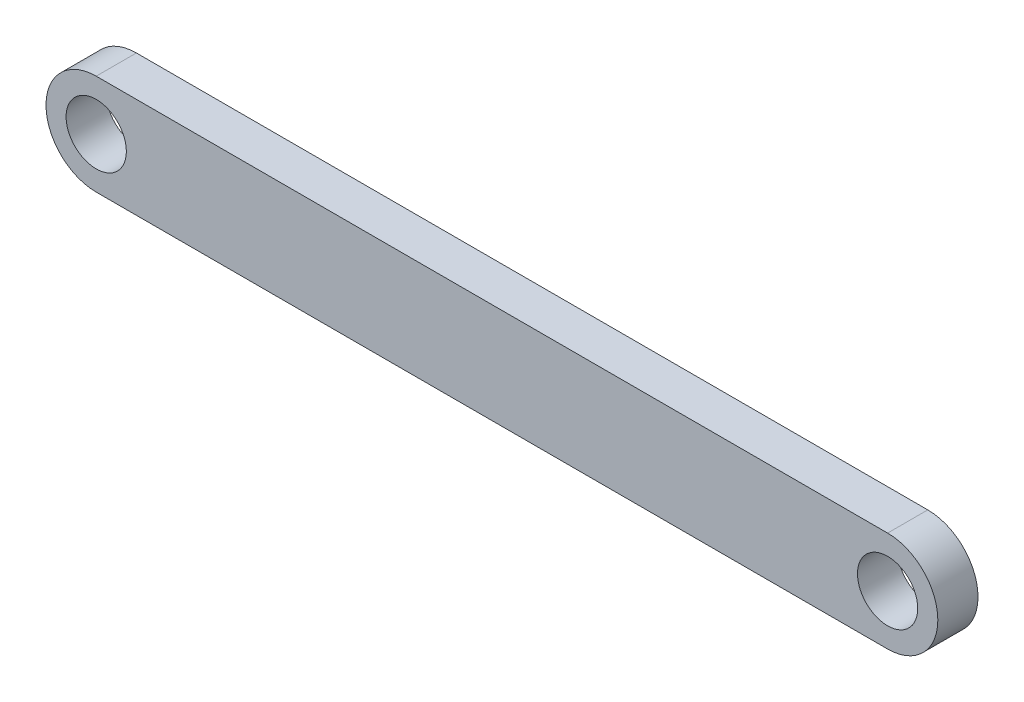
ISO-10303-21;
HEADER;
FILE_DESCRIPTION(('STEP AP214'),'2;1');
FILE_NAME('part.step','',(''),(''),'','','');
FILE_SCHEMA(('AUTOMOTIVE_DESIGN { 1 0 10303 214 1 1 1 1 }'));
ENDSEC;
DATA;
#1=APPLICATION_CONTEXT('core data for automotive mechanical design processes');
#2=APPLICATION_PROTOCOL_DEFINITION('international standard','automotive_design',2000,#1);
#3=PRODUCT_CONTEXT('',#1,'mechanical');
#4=PRODUCT('Part','Part','',(#3));
#5=PRODUCT_RELATED_PRODUCT_CATEGORY('part','',(#4));
#6=PRODUCT_DEFINITION_FORMATION('','',#4);
#7=PRODUCT_DEFINITION_CONTEXT('part definition',#1,'design');
#8=PRODUCT_DEFINITION('design','',#6,#7);
#9=PRODUCT_DEFINITION_SHAPE('','',#8);
#10=(LENGTH_UNIT() NAMED_UNIT(*) SI_UNIT(.MILLI.,.METRE.));
#11=(NAMED_UNIT(*) PLANE_ANGLE_UNIT() SI_UNIT($,.RADIAN.));
#12=(NAMED_UNIT(*) SI_UNIT($,.STERADIAN.) SOLID_ANGLE_UNIT());
#13=UNCERTAINTY_MEASURE_WITH_UNIT(LENGTH_MEASURE(1.E-05),#10,'distance_accuracy_value','');
#14=(GEOMETRIC_REPRESENTATION_CONTEXT(3) GLOBAL_UNCERTAINTY_ASSIGNED_CONTEXT((#13)) GLOBAL_UNIT_ASSIGNED_CONTEXT((#10,
#11,#12)) REPRESENTATION_CONTEXT('',''));
#15=CARTESIAN_POINT('',(0.,0.,0.));
#16=DIRECTION('',(0.,0.,1.));
#17=DIRECTION('',(1.,0.,0.));
#18=AXIS2_PLACEMENT_3D('',#15,#16,#17);
#19=CARTESIAN_POINT('',(-0.0634055440307986,-1.33638158979165,2.));
#20=DIRECTION('',(0.,0.,1.));
#21=DIRECTION('',(1.,0.,0.));
#22=AXIS2_PLACEMENT_3D('',#19,#20,#21);
#23=PLANE('',#22);
#24=CARTESIAN_POINT('',(-0.0634055440307986,-1.33638158979165,2.));
#25=DIRECTION('',(0.,0.,1.));
#26=DIRECTION('',(1.,0.,0.));
#27=AXIS2_PLACEMENT_3D('',#24,#25,#26);
#28=CIRCLE('',#27,1.5);
#29=CARTESIAN_POINT('',(1.4365944559692,-1.33638158979165,2.));
#30=VERTEX_POINT('',#29);
#31=EDGE_CURVE('E99',#30,#30,#28,.T.);
#32=ORIENTED_EDGE('',*,*,#31,.F.);
#33=EDGE_LOOP('',(#32));
#34=FACE_BOUND('',#33,.T.);
#35=CARTESIAN_POINT('',(-0.0634055440307986,-1.33638158979165,2.));
#36=DIRECTION('',(0.,0.,1.));
#37=DIRECTION('',(1.,0.,0.));
#38=AXIS2_PLACEMENT_3D('',#35,#36,#37);
#39=CIRCLE('',#38,2.5);
#40=CARTESIAN_POINT('',(-0.0634055440307986,1.16361841020835,2.));
#41=VERTEX_POINT('',#40);
#42=CARTESIAN_POINT('',(-0.0634055440307986,-3.83638158979165,2.));
#43=VERTEX_POINT('',#42);
#44=EDGE_CURVE('E84',#41,#43,#39,.T.);
#45=ORIENTED_EDGE('',*,*,#44,.T.);
#46=DIRECTION('',(1.,0.,0.));
#47=VECTOR('',#46,1.);
#48=CARTESIAN_POINT('',(-0.0634055440307986,-3.83638158979165,2.));
#49=LINE('',#48,#47);
#50=CARTESIAN_POINT('',(39.3365944559692,-3.83638158979165,2.));
#51=VERTEX_POINT('',#50);
#52=EDGE_CURVE('E79',#43,#51,#49,.T.);
#53=ORIENTED_EDGE('',*,*,#52,.T.);
#54=CARTESIAN_POINT('',(39.3365944559692,-1.33638158979165,2.));
#55=DIRECTION('',(0.,0.,1.));
#56=DIRECTION('',(1.,0.,0.));
#57=AXIS2_PLACEMENT_3D('',#54,#55,#56);
#58=CIRCLE('',#57,2.5);
#59=CARTESIAN_POINT('',(39.3365944559692,1.16361841020835,2.));
#60=VERTEX_POINT('',#59);
#61=EDGE_CURVE('E82',#51,#60,#58,.T.);
#62=ORIENTED_EDGE('',*,*,#61,.T.);
#63=DIRECTION('',(-1.,0.,0.));
#64=VECTOR('',#63,1.);
#65=CARTESIAN_POINT('',(-0.0634055440307986,1.16361841020835,2.));
#66=LINE('',#65,#64);
#67=EDGE_CURVE('E49',#60,#41,#66,.T.);
#68=ORIENTED_EDGE('',*,*,#67,.T.);
#69=EDGE_LOOP('',(#45,#53,#62,#68));
#70=FACE_BOUND('',#69,.T.);
#71=CARTESIAN_POINT('',(39.3365944559692,-1.33638158979165,2.));
#72=DIRECTION('',(0.,0.,1.));
#73=DIRECTION('',(1.,0.,0.));
#74=AXIS2_PLACEMENT_3D('',#71,#72,#73);
#75=CIRCLE('',#74,1.5);
#76=CARTESIAN_POINT('',(40.8365944559692,-1.33638158979165,2.));
#77=VERTEX_POINT('',#76);
#78=EDGE_CURVE('E114',#77,#77,#75,.T.);
#79=ORIENTED_EDGE('',*,*,#78,.F.);
#80=EDGE_LOOP('',(#79));
#81=FACE_BOUND('',#80,.T.);
#82=ADVANCED_FACE('F32',(#34,#70,#81),#23,.T.);
#83=CARTESIAN_POINT('',(-0.0634055440307986,-1.33638158979165,0.));
#84=DIRECTION('',(0.,0.,1.));
#85=DIRECTION('',(1.,0.,0.));
#86=AXIS2_PLACEMENT_3D('',#83,#84,#85);
#87=PLANE('',#86);
#88=CARTESIAN_POINT('',(-0.0634055440307986,-1.33638158979165,0.));
#89=DIRECTION('',(0.,0.,1.));
#90=DIRECTION('',(1.,0.,0.));
#91=AXIS2_PLACEMENT_3D('',#88,#89,#90);
#92=CIRCLE('',#91,2.5);
#93=CARTESIAN_POINT('',(-0.0634055440307986,1.16361841020835,0.));
#94=VERTEX_POINT('',#93);
#95=CARTESIAN_POINT('',(-0.0634055440307986,-3.83638158979165,0.));
#96=VERTEX_POINT('',#95);
#97=EDGE_CURVE('E96',#94,#96,#92,.T.);
#98=ORIENTED_EDGE('',*,*,#97,.F.);
#99=DIRECTION('',(-1.,0.,0.));
#100=VECTOR('',#99,1.);
#101=CARTESIAN_POINT('',(-0.0634055440307986,1.16361841020835,0.));
#102=LINE('',#101,#100);
#103=CARTESIAN_POINT('',(39.3365944559692,1.16361841020835,0.));
#104=VERTEX_POINT('',#103);
#105=EDGE_CURVE('E72',#104,#94,#102,.T.);
#106=ORIENTED_EDGE('',*,*,#105,.F.);
#107=CARTESIAN_POINT('',(39.3365944559692,-1.33638158979165,0.));
#108=DIRECTION('',(0.,0.,1.));
#109=DIRECTION('',(1.,0.,0.));
#110=AXIS2_PLACEMENT_3D('',#107,#108,#109);
#111=CIRCLE('',#110,2.5);
#112=CARTESIAN_POINT('',(39.3365944559692,-3.83638158979165,0.));
#113=VERTEX_POINT('',#112);
#114=EDGE_CURVE('E66',#113,#104,#111,.T.);
#115=ORIENTED_EDGE('',*,*,#114,.F.);
#116=DIRECTION('',(1.,0.,0.));
#117=VECTOR('',#116,1.);
#118=CARTESIAN_POINT('',(-0.0634055440307986,-3.83638158979165,0.));
#119=LINE('',#118,#117);
#120=EDGE_CURVE('E88',#96,#113,#119,.T.);
#121=ORIENTED_EDGE('',*,*,#120,.F.);
#122=EDGE_LOOP('',(#98,#106,#115,#121));
#123=FACE_BOUND('',#122,.T.);
#124=CARTESIAN_POINT('',(-0.0634055440307986,-1.33638158979165,0.));
#125=DIRECTION('',(0.,0.,1.));
#126=DIRECTION('',(1.,0.,0.));
#127=AXIS2_PLACEMENT_3D('',#124,#125,#126);
#128=CIRCLE('',#127,1.5);
#129=CARTESIAN_POINT('',(1.4365944559692,-1.33638158979165,0.));
#130=VERTEX_POINT('',#129);
#131=EDGE_CURVE('E111',#130,#130,#128,.T.);
#132=ORIENTED_EDGE('',*,*,#131,.T.);
#133=EDGE_LOOP('',(#132));
#134=FACE_BOUND('',#133,.T.);
#135=CARTESIAN_POINT('',(39.3365944559692,-1.33638158979165,0.));
#136=DIRECTION('',(0.,0.,1.));
#137=DIRECTION('',(1.,0.,0.));
#138=AXIS2_PLACEMENT_3D('',#135,#136,#137);
#139=CIRCLE('',#138,1.5);
#140=CARTESIAN_POINT('',(40.8365944559692,-1.33638158979165,0.));
#141=VERTEX_POINT('',#140);
#142=EDGE_CURVE('E117',#141,#141,#139,.T.);
#143=ORIENTED_EDGE('',*,*,#142,.T.);
#144=EDGE_LOOP('',(#143));
#145=FACE_BOUND('',#144,.T.);
#146=ADVANCED_FACE('F107',(#123,#134,#145),#87,.F.);
#147=CARTESIAN_POINT('',(-0.0634055440307986,-1.33638158979165,2.));
#148=DIRECTION('',(0.,0.,-1.));
#149=DIRECTION('',(-1.,0.,0.));
#150=AXIS2_PLACEMENT_3D('',#147,#148,#149);
#151=CYLINDRICAL_SURFACE('',#150,2.5);
#152=ORIENTED_EDGE('',*,*,#97,.T.);
#153=DIRECTION('',(0.,0.,-1.));
#154=VECTOR('',#153,1.);
#155=CARTESIAN_POINT('',(-0.0634055440307986,-3.83638158979165,2.));
#156=LINE('',#155,#154);
#157=EDGE_CURVE('E11',#43,#96,#156,.T.);
#158=ORIENTED_EDGE('',*,*,#157,.F.);
#159=ORIENTED_EDGE('',*,*,#44,.F.);
#160=DIRECTION('',(0.,0.,-1.));
#161=VECTOR('',#160,1.);
#162=CARTESIAN_POINT('',(-0.0634055440307986,1.16361841020835,2.));
#163=LINE('',#162,#161);
#164=EDGE_CURVE('E92',#41,#94,#163,.T.);
#165=ORIENTED_EDGE('',*,*,#164,.T.);
#166=EDGE_LOOP('',(#152,#158,#159,#165));
#167=FACE_BOUND('',#166,.T.);
#168=ADVANCED_FACE('F34',(#167),#151,.T.);
#169=CARTESIAN_POINT('',(-0.0634055440307986,-3.83638158979165,2.));
#170=DIRECTION('',(0.,1.,0.));
#171=DIRECTION('',(-1.,0.,0.));
#172=AXIS2_PLACEMENT_3D('',#169,#170,#171);
#173=PLANE('',#172);
#174=ORIENTED_EDGE('',*,*,#120,.T.);
#175=DIRECTION('',(0.,0.,-1.));
#176=VECTOR('',#175,1.);
#177=CARTESIAN_POINT('',(39.3365944559692,-3.83638158979165,2.));
#178=LINE('',#177,#176);
#179=EDGE_CURVE('E41',#51,#113,#178,.T.);
#180=ORIENTED_EDGE('',*,*,#179,.F.);
#181=ORIENTED_EDGE('',*,*,#52,.F.);
#182=ORIENTED_EDGE('',*,*,#157,.T.);
#183=EDGE_LOOP('',(#174,#180,#181,#182));
#184=FACE_BOUND('',#183,.T.);
#185=ADVANCED_FACE('F87',(#184),#173,.F.);
#186=CARTESIAN_POINT('',(39.3365944559692,-1.33638158979165,2.));
#187=DIRECTION('',(0.,0.,-1.));
#188=DIRECTION('',(-1.,0.,0.));
#189=AXIS2_PLACEMENT_3D('',#186,#187,#188);
#190=CYLINDRICAL_SURFACE('',#189,2.5);
#191=ORIENTED_EDGE('',*,*,#114,.T.);
#192=DIRECTION('',(0.,0.,-1.));
#193=VECTOR('',#192,1.);
#194=CARTESIAN_POINT('',(39.3365944559692,1.16361841020835,2.));
#195=LINE('',#194,#193);
#196=EDGE_CURVE('E89',#60,#104,#195,.T.);
#197=ORIENTED_EDGE('',*,*,#196,.F.);
#198=ORIENTED_EDGE('',*,*,#61,.F.);
#199=ORIENTED_EDGE('',*,*,#179,.T.);
#200=EDGE_LOOP('',(#191,#197,#198,#199));
#201=FACE_BOUND('',#200,.T.);
#202=ADVANCED_FACE('F90',(#201),#190,.T.);
#203=CARTESIAN_POINT('',(-0.0634055440307986,1.16361841020835,2.));
#204=DIRECTION('',(0.,-1.,0.));
#205=DIRECTION('',(0.,0.,-1.));
#206=AXIS2_PLACEMENT_3D('',#203,#204,#205);
#207=PLANE('',#206);
#208=ORIENTED_EDGE('',*,*,#105,.T.);
#209=ORIENTED_EDGE('',*,*,#164,.F.);
#210=ORIENTED_EDGE('',*,*,#67,.F.);
#211=ORIENTED_EDGE('',*,*,#196,.T.);
#212=EDGE_LOOP('',(#208,#209,#210,#211));
#213=FACE_BOUND('',#212,.T.);
#214=ADVANCED_FACE('F104',(#213),#207,.F.);
#215=CARTESIAN_POINT('',(-0.0634055440307986,-1.33638158979165,2.));
#216=DIRECTION('',(0.,0.,-1.));
#217=DIRECTION('',(-1.,0.,0.));
#218=AXIS2_PLACEMENT_3D('',#215,#216,#217);
#219=CYLINDRICAL_SURFACE('',#218,1.5);
#220=ORIENTED_EDGE('',*,*,#31,.T.);
#221=EDGE_LOOP('',(#220));
#222=FACE_BOUND('',#221,.T.);
#223=ORIENTED_EDGE('',*,*,#131,.F.);
#224=EDGE_LOOP('',(#223));
#225=FACE_BOUND('',#224,.T.);
#226=ADVANCED_FACE('F134',(#222,#225),#219,.F.);
#227=CARTESIAN_POINT('',(39.3365944559692,-1.33638158979165,2.));
#228=DIRECTION('',(0.,0.,-1.));
#229=DIRECTION('',(-1.,0.,0.));
#230=AXIS2_PLACEMENT_3D('',#227,#228,#229);
#231=CYLINDRICAL_SURFACE('',#230,1.5);
#232=ORIENTED_EDGE('',*,*,#78,.T.);
#233=EDGE_LOOP('',(#232));
#234=FACE_BOUND('',#233,.T.);
#235=ORIENTED_EDGE('',*,*,#142,.F.);
#236=EDGE_LOOP('',(#235));
#237=FACE_BOUND('',#236,.T.);
#238=ADVANCED_FACE('F123',(#234,#237),#231,.F.);
#239=CLOSED_SHELL('',(#82,#146,#168,#185,#202,#214,#226,#238));
#240=MANIFOLD_SOLID_BREP('B2',#239);
#241=ADVANCED_BREP_SHAPE_REPRESENTATION('',(#18,#240),#14);
#242=SHAPE_DEFINITION_REPRESENTATION(#9,#241);
ENDSEC;
END-ISO-10303-21;
